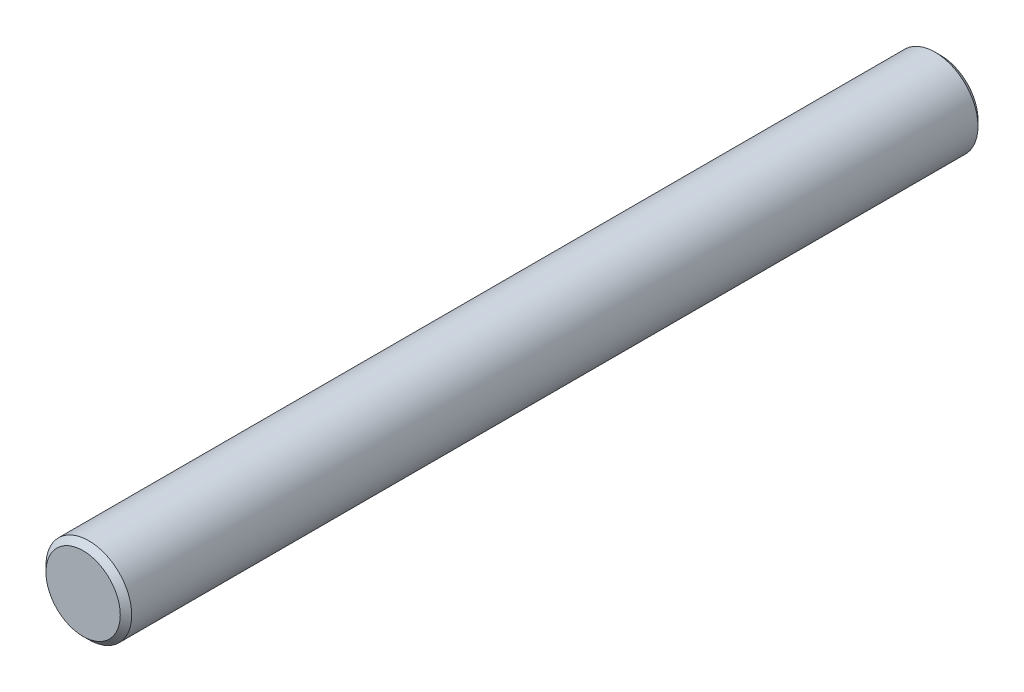
ISO-10303-21;
HEADER;
FILE_DESCRIPTION(('STEP AP214'),'2;1');
FILE_NAME('part.step','',(''),(''),'','','');
FILE_SCHEMA(('AUTOMOTIVE_DESIGN { 1 0 10303 214 1 1 1 1 }'));
ENDSEC;
DATA;
#1=APPLICATION_CONTEXT('core data for automotive mechanical design processes');
#2=APPLICATION_PROTOCOL_DEFINITION('international standard','automotive_design',2000,#1);
#3=PRODUCT_CONTEXT('',#1,'mechanical');
#4=PRODUCT('Part','Part','',(#3));
#5=PRODUCT_RELATED_PRODUCT_CATEGORY('part','',(#4));
#6=PRODUCT_DEFINITION_FORMATION('','',#4);
#7=PRODUCT_DEFINITION_CONTEXT('part definition',#1,'design');
#8=PRODUCT_DEFINITION('design','',#6,#7);
#9=PRODUCT_DEFINITION_SHAPE('','',#8);
#10=(LENGTH_UNIT() NAMED_UNIT(*) SI_UNIT(.MILLI.,.METRE.));
#11=(NAMED_UNIT(*) PLANE_ANGLE_UNIT() SI_UNIT($,.RADIAN.));
#12=(NAMED_UNIT(*) SI_UNIT($,.STERADIAN.) SOLID_ANGLE_UNIT());
#13=UNCERTAINTY_MEASURE_WITH_UNIT(LENGTH_MEASURE(1.E-05),#10,'distance_accuracy_value','');
#14=(GEOMETRIC_REPRESENTATION_CONTEXT(3) GLOBAL_UNCERTAINTY_ASSIGNED_CONTEXT((#13)) GLOBAL_UNIT_ASSIGNED_CONTEXT((#10,
#11,#12)) REPRESENTATION_CONTEXT('',''));
#15=CARTESIAN_POINT('',(0.,0.,0.));
#16=DIRECTION('',(0.,0.,1.));
#17=DIRECTION('',(1.,0.,0.));
#18=AXIS2_PLACEMENT_3D('',#15,#16,#17);
#19=CARTESIAN_POINT('',(0.,0.,30.));
#20=DIRECTION('',(0.,0.,-1.));
#21=DIRECTION('',(-1.,0.,0.));
#22=AXIS2_PLACEMENT_3D('',#19,#20,#21);
#23=CYLINDRICAL_SURFACE('',#22,1.5);
#24=CARTESIAN_POINT('',(0.,0.,0.200000000000002));
#25=DIRECTION('',(0.,0.,1.));
#26=DIRECTION('',(1.,0.,0.));
#27=AXIS2_PLACEMENT_3D('',#24,#25,#26);
#28=CIRCLE('',#27,1.5);
#29=CARTESIAN_POINT('',(1.5,0.,0.200000000000002));
#30=VERTEX_POINT('',#29);
#31=EDGE_CURVE('E50',#30,#30,#28,.T.);
#32=ORIENTED_EDGE('',*,*,#31,.T.);
#33=EDGE_LOOP('',(#32));
#34=FACE_BOUND('',#33,.T.);
#35=CARTESIAN_POINT('',(0.,0.,29.8));
#36=DIRECTION('',(0.,0.,1.));
#37=DIRECTION('',(1.,0.,0.));
#38=AXIS2_PLACEMENT_3D('',#35,#36,#37);
#39=CIRCLE('',#38,1.5);
#40=CARTESIAN_POINT('',(1.5,0.,29.8));
#41=VERTEX_POINT('',#40);
#42=EDGE_CURVE('E55',#41,#41,#39,.F.);
#43=ORIENTED_EDGE('',*,*,#42,.T.);
#44=EDGE_LOOP('',(#43));
#45=FACE_BOUND('',#44,.T.);
#46=ADVANCED_FACE('F37',(#34,#45),#23,.T.);
#47=CARTESIAN_POINT('',(0.,0.,30.));
#48=DIRECTION('',(0.,0.,1.));
#49=DIRECTION('',(1.,0.,0.));
#50=AXIS2_PLACEMENT_3D('',#47,#48,#49);
#51=PLANE('',#50);
#52=CARTESIAN_POINT('',(0.,0.,30.));
#53=DIRECTION('',(0.,0.,1.));
#54=DIRECTION('',(1.,0.,0.));
#55=AXIS2_PLACEMENT_3D('',#52,#53,#54);
#56=CIRCLE('',#55,1.30000000000001);
#57=CARTESIAN_POINT('',(1.30000000000001,0.,30.));
#58=VERTEX_POINT('',#57);
#59=EDGE_CURVE('E10',#58,#58,#56,.T.);
#60=ORIENTED_EDGE('',*,*,#59,.T.);
#61=EDGE_LOOP('',(#60));
#62=FACE_BOUND('',#61,.T.);
#63=ADVANCED_FACE('F72',(#62),#51,.T.);
#64=CARTESIAN_POINT('',(0.,0.,0.));
#65=DIRECTION('',(0.,0.,1.));
#66=DIRECTION('',(1.,0.,0.));
#67=AXIS2_PLACEMENT_3D('',#64,#65,#66);
#68=PLANE('',#67);
#69=CARTESIAN_POINT('',(0.,0.,0.));
#70=DIRECTION('',(0.,0.,1.));
#71=DIRECTION('',(1.,0.,0.));
#72=AXIS2_PLACEMENT_3D('',#69,#70,#71);
#73=CIRCLE('',#72,1.3);
#74=CARTESIAN_POINT('',(1.3,0.,0.));
#75=VERTEX_POINT('',#74);
#76=EDGE_CURVE('E45',#75,#75,#73,.F.);
#77=ORIENTED_EDGE('',*,*,#76,.T.);
#78=EDGE_LOOP('',(#77));
#79=FACE_BOUND('',#78,.T.);
#80=ADVANCED_FACE('F69',(#79),#68,.F.);
#81=CARTESIAN_POINT('',(0.,0.,0.200000000000002));
#82=DIRECTION('',(0.,0.,1.));
#83=DIRECTION('',(1.,0.,0.));
#84=AXIS2_PLACEMENT_3D('',#81,#82,#83);
#85=CONICAL_SURFACE('',#84,1.5,0.785398163397454);
#86=ORIENTED_EDGE('',*,*,#76,.F.);
#87=EDGE_LOOP('',(#86));
#88=FACE_BOUND('',#87,.T.);
#89=ORIENTED_EDGE('',*,*,#31,.F.);
#90=EDGE_LOOP('',(#89));
#91=FACE_BOUND('',#90,.T.);
#92=ADVANCED_FACE('F65',(#88,#91),#85,.T.);
#93=CARTESIAN_POINT('',(0.,0.,30.));
#94=DIRECTION('',(0.,0.,-1.));
#95=DIRECTION('',(-1.,0.,0.));
#96=AXIS2_PLACEMENT_3D('',#93,#94,#95);
#97=CONICAL_SURFACE('',#96,1.30000000000001,0.785398163397437);
#98=ORIENTED_EDGE('',*,*,#42,.F.);
#99=EDGE_LOOP('',(#98));
#100=FACE_BOUND('',#99,.T.);
#101=ORIENTED_EDGE('',*,*,#59,.F.);
#102=EDGE_LOOP('',(#101));
#103=FACE_BOUND('',#102,.T.);
#104=ADVANCED_FACE('F39',(#100,#103),#97,.T.);
#105=CLOSED_SHELL('',(#46,#63,#80,#92,#104));
#106=MANIFOLD_SOLID_BREP('B2',#105);
#107=ADVANCED_BREP_SHAPE_REPRESENTATION('',(#18,#106),#14);
#108=SHAPE_DEFINITION_REPRESENTATION(#9,#107);
ENDSEC;
END-ISO-10303-21;
